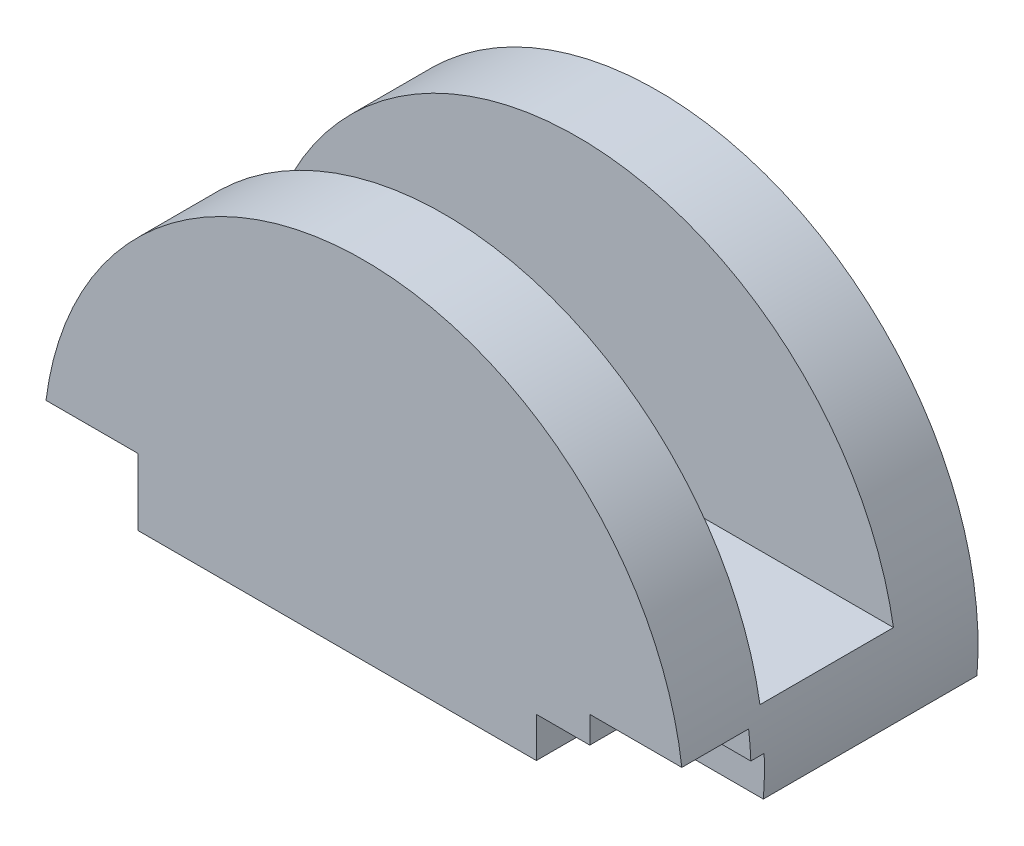
ISO-10303-21;
HEADER;
FILE_DESCRIPTION(('STEP AP214'),'2;1');
FILE_NAME('part.step','',(''),(''),'','','');
FILE_SCHEMA(('AUTOMOTIVE_DESIGN { 1 0 10303 214 1 1 1 1 }'));
ENDSEC;
DATA;
#1=APPLICATION_CONTEXT('core data for automotive mechanical design processes');
#2=APPLICATION_PROTOCOL_DEFINITION('international standard','automotive_design',2000,#1);
#3=PRODUCT_CONTEXT('',#1,'mechanical');
#4=PRODUCT('Part','Part','',(#3));
#5=PRODUCT_RELATED_PRODUCT_CATEGORY('part','',(#4));
#6=PRODUCT_DEFINITION_FORMATION('','',#4);
#7=PRODUCT_DEFINITION_CONTEXT('part definition',#1,'design');
#8=PRODUCT_DEFINITION('design','',#6,#7);
#9=PRODUCT_DEFINITION_SHAPE('','',#8);
#10=(LENGTH_UNIT() NAMED_UNIT(*) SI_UNIT(.MILLI.,.METRE.));
#11=(NAMED_UNIT(*) PLANE_ANGLE_UNIT() SI_UNIT($,.RADIAN.));
#12=(NAMED_UNIT(*) SI_UNIT($,.STERADIAN.) SOLID_ANGLE_UNIT());
#13=UNCERTAINTY_MEASURE_WITH_UNIT(LENGTH_MEASURE(1.E-05),#10,'distance_accuracy_value','');
#14=(GEOMETRIC_REPRESENTATION_CONTEXT(3) GLOBAL_UNCERTAINTY_ASSIGNED_CONTEXT((#13)) GLOBAL_UNIT_ASSIGNED_CONTEXT((#10,
#11,#12)) REPRESENTATION_CONTEXT('',''));
#15=CARTESIAN_POINT('',(0.,0.,0.));
#16=DIRECTION('',(0.,0.,1.));
#17=DIRECTION('',(1.,0.,0.));
#18=AXIS2_PLACEMENT_3D('',#15,#16,#17);
#19=CARTESIAN_POINT('',(0.,3.,5.5));
#20=DIRECTION('',(0.,1.,0.));
#21=DIRECTION('',(0.,0.,1.));
#22=AXIS2_PLACEMENT_3D('',#19,#20,#21);
#23=PLANE('',#22);
#24=CARTESIAN_POINT('',(0.,3.,5.5));
#25=DIRECTION('',(0.,1.,0.));
#26=DIRECTION('',(0.,0.,1.));
#27=AXIS2_PLACEMENT_3D('',#24,#25,#26);
#28=CIRCLE('',#27,4.25);
#29=CARTESIAN_POINT('',(-3.43693177121688,3.,8.));
#30=VERTEX_POINT('',#29);
#31=CARTESIAN_POINT('',(3.43693177121688,3.,8.));
#32=VERTEX_POINT('',#31);
#33=EDGE_CURVE('E246',#30,#32,#28,.T.);
#34=ORIENTED_EDGE('',*,*,#33,.F.);
#35=DIRECTION('',(1.,0.,0.));
#36=VECTOR('',#35,1.);
#37=CARTESIAN_POINT('',(0.,3.,8.));
#38=LINE('',#37,#36);
#39=EDGE_CURVE('E269',#30,#32,#38,.T.);
#40=ORIENTED_EDGE('',*,*,#39,.T.);
#41=EDGE_LOOP('',(#34,#40));
#42=FACE_BOUND('',#41,.T.);
#43=ADVANCED_FACE('F33',(#42),#23,.F.);
#44=CARTESIAN_POINT('',(0.,0.,11.));
#45=DIRECTION('',(0.,0.,-1.));
#46=DIRECTION('',(-1.,0.,0.));
#47=AXIS2_PLACEMENT_3D('',#44,#45,#46);
#48=CYLINDRICAL_SURFACE('',#47,12.);
#49=CARTESIAN_POINT('',(0.,0.,8.));
#50=DIRECTION('',(0.,0.,1.));
#51=DIRECTION('',(1.,0.,0.));
#52=AXIS2_PLACEMENT_3D('',#49,#50,#51);
#53=CIRCLE('',#52,12.);
#54=CARTESIAN_POINT('',(11.8321595661992,2.,8.));
#55=VERTEX_POINT('',#54);
#56=CARTESIAN_POINT('',(-11.8321595661992,2.,8.));
#57=VERTEX_POINT('',#56);
#58=EDGE_CURVE('E236',#55,#57,#53,.T.);
#59=ORIENTED_EDGE('',*,*,#58,.T.);
#60=DIRECTION('',(0.,0.,-1.));
#61=VECTOR('',#60,1.);
#62=CARTESIAN_POINT('',(-11.8321595661992,2.,11.));
#63=LINE('',#62,#61);
#64=CARTESIAN_POINT('',(-11.8321595661992,2.,3.));
#65=VERTEX_POINT('',#64);
#66=EDGE_CURVE('E242',#57,#65,#63,.T.);
#67=ORIENTED_EDGE('',*,*,#66,.T.);
#68=CARTESIAN_POINT('',(0.,0.,3.));
#69=DIRECTION('',(0.,0.,-1.));
#70=DIRECTION('',(-1.,0.,0.));
#71=AXIS2_PLACEMENT_3D('',#68,#69,#70);
#72=CIRCLE('',#71,12.);
#73=CARTESIAN_POINT('',(11.8321595661992,2.,3.));
#74=VERTEX_POINT('',#73);
#75=EDGE_CURVE('E229',#65,#74,#72,.T.);
#76=ORIENTED_EDGE('',*,*,#75,.T.);
#77=DIRECTION('',(0.,0.,-1.));
#78=VECTOR('',#77,1.);
#79=CARTESIAN_POINT('',(11.8321595661992,2.,11.));
#80=LINE('',#79,#78);
#81=EDGE_CURVE('E239',#74,#55,#80,.F.);
#82=ORIENTED_EDGE('',*,*,#81,.T.);
#83=EDGE_LOOP('',(#59,#67,#76,#82));
#84=FACE_BOUND('',#83,.T.);
#85=CARTESIAN_POINT('',(0.,0.,11.));
#86=DIRECTION('',(0.,0.,1.));
#87=DIRECTION('',(1.,0.,0.));
#88=AXIS2_PLACEMENT_3D('',#85,#86,#87);
#89=CIRCLE('',#88,12.);
#90=CARTESIAN_POINT('',(11.9058808997907,1.5,11.));
#91=VERTEX_POINT('',#90);
#92=CARTESIAN_POINT('',(-11.9058808997907,1.5,11.));
#93=VERTEX_POINT('',#92);
#94=EDGE_CURVE('E252',#91,#93,#89,.T.);
#95=ORIENTED_EDGE('',*,*,#94,.F.);
#96=DIRECTION('',(0.,0.,-1.));
#97=VECTOR('',#96,1.);
#98=CARTESIAN_POINT('',(11.9058808997907,1.5,11.));
#99=LINE('',#98,#97);
#100=CARTESIAN_POINT('',(11.9058808997907,1.5,8.5));
#101=VERTEX_POINT('',#100);
#102=EDGE_CURVE('E174',#91,#101,#99,.T.);
#103=ORIENTED_EDGE('',*,*,#102,.T.);
#104=CARTESIAN_POINT('',(0.,0.,8.5));
#105=DIRECTION('',(0.,0.,-1.));
#106=DIRECTION('',(-1.,0.,0.));
#107=AXIS2_PLACEMENT_3D('',#104,#105,#106);
#108=CIRCLE('',#107,12.);
#109=CARTESIAN_POINT('',(11.9895788082818,0.5,8.5));
#110=VERTEX_POINT('',#109);
#111=EDGE_CURVE('E154',#101,#110,#108,.T.);
#112=ORIENTED_EDGE('',*,*,#111,.T.);
#113=DIRECTION('',(0.,0.,-1.));
#114=VECTOR('',#113,1.);
#115=CARTESIAN_POINT('',(11.9895788082818,0.5,11.));
#116=LINE('',#115,#114);
#117=CARTESIAN_POINT('',(11.9895788082818,0.5,8.));
#118=VERTEX_POINT('',#117);
#119=EDGE_CURVE('E211',#110,#118,#116,.T.);
#120=ORIENTED_EDGE('',*,*,#119,.T.);
#121=CARTESIAN_POINT('',(0.,0.,8.));
#122=DIRECTION('',(0.,0.,-1.));
#123=DIRECTION('',(-1.,0.,0.));
#124=AXIS2_PLACEMENT_3D('',#121,#122,#123);
#125=CIRCLE('',#124,12.);
#126=CARTESIAN_POINT('',(11.9582607431014,-1.,8.));
#127=VERTEX_POINT('',#126);
#128=EDGE_CURVE('E215',#118,#127,#125,.T.);
#129=ORIENTED_EDGE('',*,*,#128,.T.);
#130=DIRECTION('',(0.,0.,-1.));
#131=VECTOR('',#130,1.);
#132=CARTESIAN_POINT('',(11.9582607431014,-1.,11.));
#133=LINE('',#132,#131);
#134=CARTESIAN_POINT('',(11.9582607431014,-1.,0.));
#135=VERTEX_POINT('',#134);
#136=EDGE_CURVE('E257',#127,#135,#133,.T.);
#137=ORIENTED_EDGE('',*,*,#136,.T.);
#138=CARTESIAN_POINT('',(0.,0.,0.));
#139=DIRECTION('',(0.,0.,1.));
#140=DIRECTION('',(1.,0.,0.));
#141=AXIS2_PLACEMENT_3D('',#138,#139,#140);
#142=CIRCLE('',#141,12.);
#143=CARTESIAN_POINT('',(-11.9582607431014,-1.,0.));
#144=VERTEX_POINT('',#143);
#145=EDGE_CURVE('E258',#135,#144,#142,.T.);
#146=ORIENTED_EDGE('',*,*,#145,.T.);
#147=DIRECTION('',(0.,0.,-1.));
#148=VECTOR('',#147,1.);
#149=CARTESIAN_POINT('',(-11.9582607431014,-1.,11.));
#150=LINE('',#149,#148);
#151=CARTESIAN_POINT('',(-11.9582607431014,-1.,8.5));
#152=VERTEX_POINT('',#151);
#153=EDGE_CURVE('E264',#152,#144,#150,.T.);
#154=ORIENTED_EDGE('',*,*,#153,.F.);
#155=CARTESIAN_POINT('',(0.,0.,8.5));
#156=DIRECTION('',(0.,0.,1.));
#157=DIRECTION('',(1.,0.,0.));
#158=AXIS2_PLACEMENT_3D('',#155,#156,#157);
#159=CIRCLE('',#158,12.);
#160=CARTESIAN_POINT('',(-11.9058808997907,1.5,8.5));
#161=VERTEX_POINT('',#160);
#162=EDGE_CURVE('E195',#161,#152,#159,.T.);
#163=ORIENTED_EDGE('',*,*,#162,.F.);
#164=DIRECTION('',(0.,0.,-1.));
#165=VECTOR('',#164,1.);
#166=CARTESIAN_POINT('',(-11.9058808997907,1.5,11.));
#167=LINE('',#166,#165);
#168=EDGE_CURVE('E191',#161,#93,#167,.F.);
#169=ORIENTED_EDGE('',*,*,#168,.T.);
#170=EDGE_LOOP('',(#95,#103,#112,#120,#129,#137,#146,#154,#163,#169));
#171=FACE_BOUND('',#170,.T.);
#172=ADVANCED_FACE('F35',(#84,#171),#48,.T.);
#173=CARTESIAN_POINT('',(-11.9582607431014,-1.,11.));
#174=DIRECTION('',(0.,1.,0.));
#175=DIRECTION('',(0.,0.,1.));
#176=AXIS2_PLACEMENT_3D('',#173,#174,#175);
#177=PLANE('',#176);
#178=CARTESIAN_POINT('',(0.,-1.,5.5));
#179=DIRECTION('',(0.,1.,0.));
#180=DIRECTION('',(0.,0.,1.));
#181=AXIS2_PLACEMENT_3D('',#178,#179,#180);
#182=CIRCLE('',#181,4.25);
#183=CARTESIAN_POINT('',(0.,-1.,9.75));
#184=VERTEX_POINT('',#183);
#185=EDGE_CURVE('E245',#184,#184,#182,.T.);
#186=ORIENTED_EDGE('',*,*,#185,.T.);
#187=EDGE_LOOP('',(#186));
#188=FACE_BOUND('',#187,.T.);
#189=DIRECTION('',(1.,0.,0.));
#190=VECTOR('',#189,1.);
#191=CARTESIAN_POINT('',(-11.9582607431014,-1.,11.));
#192=LINE('',#191,#190);
#193=CARTESIAN_POINT('',(-8.4582607431014,-1.,11.));
#194=VERTEX_POINT('',#193);
#195=CARTESIAN_POINT('',(6.4582607431014,-1.,11.));
#196=VERTEX_POINT('',#195);
#197=EDGE_CURVE('E254',#194,#196,#192,.T.);
#198=ORIENTED_EDGE('',*,*,#197,.F.);
#199=DIRECTION('',(0.,0.,1.));
#200=VECTOR('',#199,1.);
#201=CARTESIAN_POINT('',(-8.4582607431014,-1.,8.5));
#202=LINE('',#201,#200);
#203=CARTESIAN_POINT('',(-8.4582607431014,-1.,8.5));
#204=VERTEX_POINT('',#203);
#205=EDGE_CURVE('E189',#204,#194,#202,.T.);
#206=ORIENTED_EDGE('',*,*,#205,.F.);
#207=DIRECTION('',(1.,0.,0.));
#208=VECTOR('',#207,1.);
#209=CARTESIAN_POINT('',(-8.4582607431014,-1.,8.5));
#210=LINE('',#209,#208);
#211=EDGE_CURVE('E183',#152,#204,#210,.T.);
#212=ORIENTED_EDGE('',*,*,#211,.F.);
#213=ORIENTED_EDGE('',*,*,#153,.T.);
#214=DIRECTION('',(1.,0.,0.));
#215=VECTOR('',#214,1.);
#216=CARTESIAN_POINT('',(-11.9582607431014,-1.,0.));
#217=LINE('',#216,#215);
#218=EDGE_CURVE('E255',#144,#135,#217,.T.);
#219=ORIENTED_EDGE('',*,*,#218,.T.);
#220=ORIENTED_EDGE('',*,*,#136,.F.);
#221=DIRECTION('',(1.,0.,0.));
#222=VECTOR('',#221,1.);
#223=CARTESIAN_POINT('',(6.4582607431014,-1.,8.));
#224=LINE('',#223,#222);
#225=CARTESIAN_POINT('',(6.4582607431014,-1.,8.));
#226=VERTEX_POINT('',#225);
#227=EDGE_CURVE('E201',#226,#127,#224,.T.);
#228=ORIENTED_EDGE('',*,*,#227,.F.);
#229=DIRECTION('',(0.,0.,1.));
#230=VECTOR('',#229,1.);
#231=CARTESIAN_POINT('',(6.4582607431014,-1.,8.));
#232=LINE('',#231,#230);
#233=EDGE_CURVE('E205',#226,#196,#232,.T.);
#234=ORIENTED_EDGE('',*,*,#233,.T.);
#235=EDGE_LOOP('',(#198,#206,#212,#213,#219,#220,#228,#234));
#236=FACE_BOUND('',#235,.T.);
#237=ADVANCED_FACE('F298',(#188,#236),#177,.F.);
#238=CARTESIAN_POINT('',(0.,0.,11.));
#239=DIRECTION('',(0.,0.,1.));
#240=DIRECTION('',(1.,0.,0.));
#241=AXIS2_PLACEMENT_3D('',#238,#239,#240);
#242=PLANE('',#241);
#243=DIRECTION('',(0.,-1.,0.));
#244=VECTOR('',#243,1.);
#245=CARTESIAN_POINT('',(8.4582607431014,-1.,11.));
#246=LINE('',#245,#244);
#247=CARTESIAN_POINT('',(8.4582607431014,1.5,11.));
#248=VERTEX_POINT('',#247);
#249=CARTESIAN_POINT('',(8.4582607431014,0.5,11.));
#250=VERTEX_POINT('',#249);
#251=EDGE_CURVE('E169',#248,#250,#246,.T.);
#252=ORIENTED_EDGE('',*,*,#251,.F.);
#253=DIRECTION('',(-1.,0.,0.));
#254=VECTOR('',#253,1.);
#255=CARTESIAN_POINT('',(8.4582607431014,1.5,11.));
#256=LINE('',#255,#254);
#257=EDGE_CURVE('E162',#91,#248,#256,.T.);
#258=ORIENTED_EDGE('',*,*,#257,.F.);
#259=ORIENTED_EDGE('',*,*,#94,.T.);
#260=DIRECTION('',(-1.,0.,0.));
#261=VECTOR('',#260,1.);
#262=CARTESIAN_POINT('',(-8.4582607431014,1.5,11.));
#263=LINE('',#262,#261);
#264=CARTESIAN_POINT('',(-8.4582607431014,1.5,11.));
#265=VERTEX_POINT('',#264);
#266=EDGE_CURVE('E180',#265,#93,#263,.T.);
#267=ORIENTED_EDGE('',*,*,#266,.F.);
#268=DIRECTION('',(0.,1.,0.));
#269=VECTOR('',#268,1.);
#270=CARTESIAN_POINT('',(-8.4582607431014,-1.,11.));
#271=LINE('',#270,#269);
#272=EDGE_CURVE('E56',#194,#265,#271,.T.);
#273=ORIENTED_EDGE('',*,*,#272,.F.);
#274=ORIENTED_EDGE('',*,*,#197,.T.);
#275=DIRECTION('',(0.,-1.,0.));
#276=VECTOR('',#275,1.);
#277=CARTESIAN_POINT('',(6.4582607431014,-1.,11.));
#278=LINE('',#277,#276);
#279=CARTESIAN_POINT('',(6.4582607431014,0.5,11.));
#280=VERTEX_POINT('',#279);
#281=EDGE_CURVE('E197',#280,#196,#278,.T.);
#282=ORIENTED_EDGE('',*,*,#281,.F.);
#283=DIRECTION('',(-1.,0.,0.));
#284=VECTOR('',#283,1.);
#285=CARTESIAN_POINT('',(0.,0.5,11.));
#286=LINE('',#285,#284);
#287=EDGE_CURVE('E275',#250,#280,#286,.T.);
#288=ORIENTED_EDGE('',*,*,#287,.F.);
#289=EDGE_LOOP('',(#252,#258,#259,#267,#273,#274,#282,#288));
#290=FACE_BOUND('',#289,.T.);
#291=ADVANCED_FACE('F285',(#290),#242,.T.);
#292=CARTESIAN_POINT('',(0.,0.,0.));
#293=DIRECTION('',(0.,0.,1.));
#294=DIRECTION('',(1.,0.,0.));
#295=AXIS2_PLACEMENT_3D('',#292,#293,#294);
#296=PLANE('',#295);
#297=ORIENTED_EDGE('',*,*,#145,.F.);
#298=ORIENTED_EDGE('',*,*,#218,.F.);
#299=EDGE_LOOP('',(#297,#298));
#300=FACE_BOUND('',#299,.T.);
#301=ADVANCED_FACE('F304',(#300),#296,.F.);
#302=CARTESIAN_POINT('',(0.,3.,5.5));
#303=DIRECTION('',(0.,-1.,0.));
#304=DIRECTION('',(0.,0.,-1.));
#305=AXIS2_PLACEMENT_3D('',#302,#303,#304);
#306=CYLINDRICAL_SURFACE('',#305,4.25);
#307=DIRECTION('',(0.,-1.,0.));
#308=VECTOR('',#307,1.);
#309=CARTESIAN_POINT('',(3.43693177121688,3.,8.));
#310=LINE('',#309,#308);
#311=CARTESIAN_POINT('',(3.43693177121688,2.,8.));
#312=VERTEX_POINT('',#311);
#313=EDGE_CURVE('E232',#312,#32,#310,.F.);
#314=ORIENTED_EDGE('',*,*,#313,.F.);
#315=CARTESIAN_POINT('',(0.,2.,5.5));
#316=DIRECTION('',(0.,-1.,0.));
#317=DIRECTION('',(0.,0.,-1.));
#318=AXIS2_PLACEMENT_3D('',#315,#316,#317);
#319=CIRCLE('',#318,4.25);
#320=CARTESIAN_POINT('',(3.43693177121688,2.,3.));
#321=VERTEX_POINT('',#320);
#322=EDGE_CURVE('E274',#321,#312,#319,.T.);
#323=ORIENTED_EDGE('',*,*,#322,.F.);
#324=DIRECTION('',(0.,-1.,0.));
#325=VECTOR('',#324,1.);
#326=CARTESIAN_POINT('',(3.43693177121688,3.,3.));
#327=LINE('',#326,#325);
#328=CARTESIAN_POINT('',(3.43693177121688,3.,3.));
#329=VERTEX_POINT('',#328);
#330=EDGE_CURVE('E227',#329,#321,#327,.T.);
#331=ORIENTED_EDGE('',*,*,#330,.F.);
#332=CARTESIAN_POINT('',(-3.43693177121688,3.,3.));
#333=VERTEX_POINT('',#332);
#334=EDGE_CURVE('E249',#329,#333,#28,.T.);
#335=ORIENTED_EDGE('',*,*,#334,.T.);
#336=DIRECTION('',(0.,-1.,0.));
#337=VECTOR('',#336,1.);
#338=CARTESIAN_POINT('',(-3.43693177121688,3.,3.));
#339=LINE('',#338,#337);
#340=CARTESIAN_POINT('',(-3.43693177121688,2.,3.));
#341=VERTEX_POINT('',#340);
#342=EDGE_CURVE('E225',#341,#333,#339,.F.);
#343=ORIENTED_EDGE('',*,*,#342,.F.);
#344=CARTESIAN_POINT('',(-3.43693177121688,2.,8.));
#345=VERTEX_POINT('',#344);
#346=EDGE_CURVE('E272',#345,#341,#319,.T.);
#347=ORIENTED_EDGE('',*,*,#346,.F.);
#348=DIRECTION('',(0.,-1.,0.));
#349=VECTOR('',#348,1.);
#350=CARTESIAN_POINT('',(-3.43693177121688,3.,8.));
#351=LINE('',#350,#349);
#352=EDGE_CURVE('E234',#30,#345,#351,.T.);
#353=ORIENTED_EDGE('',*,*,#352,.F.);
#354=ORIENTED_EDGE('',*,*,#33,.T.);
#355=EDGE_LOOP('',(#314,#323,#331,#335,#343,#347,#353,#354));
#356=FACE_BOUND('',#355,.T.);
#357=ORIENTED_EDGE('',*,*,#185,.F.);
#358=EDGE_LOOP('',(#357));
#359=FACE_BOUND('',#358,.T.);
#360=ADVANCED_FACE('F306',(#356,#359),#306,.F.);
#361=ORIENTED_EDGE('',*,*,#334,.F.);
#362=DIRECTION('',(-1.,0.,0.));
#363=VECTOR('',#362,1.);
#364=CARTESIAN_POINT('',(0.,3.,3.));
#365=LINE('',#364,#363);
#366=EDGE_CURVE('E266',#329,#333,#365,.T.);
#367=ORIENTED_EDGE('',*,*,#366,.T.);
#368=EDGE_LOOP('',(#361,#367));
#369=FACE_BOUND('',#368,.T.);
#370=ADVANCED_FACE('F312',(#369),#23,.F.);
#371=CARTESIAN_POINT('',(-12.,2.,8.));
#372=DIRECTION('',(0.,-1.,0.));
#373=DIRECTION('',(0.,0.,-1.));
#374=AXIS2_PLACEMENT_3D('',#371,#372,#373);
#375=PLANE('',#374);
#376=DIRECTION('',(1.,0.,0.));
#377=VECTOR('',#376,1.);
#378=CARTESIAN_POINT('',(-12.,2.,8.));
#379=LINE('',#378,#377);
#380=EDGE_CURVE('E223',#57,#345,#379,.T.);
#381=ORIENTED_EDGE('',*,*,#380,.T.);
#382=ORIENTED_EDGE('',*,*,#346,.T.);
#383=DIRECTION('',(1.,0.,0.));
#384=VECTOR('',#383,1.);
#385=CARTESIAN_POINT('',(-12.,2.,3.));
#386=LINE('',#385,#384);
#387=EDGE_CURVE('E222',#65,#341,#386,.T.);
#388=ORIENTED_EDGE('',*,*,#387,.F.);
#389=ORIENTED_EDGE('',*,*,#66,.F.);
#390=EDGE_LOOP('',(#381,#382,#388,#389));
#391=FACE_BOUND('',#390,.T.);
#392=ADVANCED_FACE('F326',(#391),#375,.F.);
#393=EDGE_CURVE('E219',#321,#74,#386,.T.);
#394=ORIENTED_EDGE('',*,*,#393,.F.);
#395=ORIENTED_EDGE('',*,*,#322,.T.);
#396=EDGE_CURVE('E218',#312,#55,#379,.T.);
#397=ORIENTED_EDGE('',*,*,#396,.T.);
#398=ORIENTED_EDGE('',*,*,#81,.F.);
#399=EDGE_LOOP('',(#394,#395,#397,#398));
#400=FACE_BOUND('',#399,.T.);
#401=ADVANCED_FACE('F331',(#400),#375,.F.);
#402=CARTESIAN_POINT('',(-12.,2.,8.));
#403=DIRECTION('',(0.,0.,1.));
#404=DIRECTION('',(1.,0.,0.));
#405=AXIS2_PLACEMENT_3D('',#402,#403,#404);
#406=PLANE('',#405);
#407=ORIENTED_EDGE('',*,*,#396,.F.);
#408=ORIENTED_EDGE('',*,*,#313,.T.);
#409=ORIENTED_EDGE('',*,*,#39,.F.);
#410=ORIENTED_EDGE('',*,*,#352,.T.);
#411=ORIENTED_EDGE('',*,*,#380,.F.);
#412=ORIENTED_EDGE('',*,*,#58,.F.);
#413=EDGE_LOOP('',(#407,#408,#409,#410,#411,#412));
#414=FACE_BOUND('',#413,.T.);
#415=ADVANCED_FACE('F354',(#414),#406,.F.);
#416=CARTESIAN_POINT('',(-12.,2.,3.));
#417=DIRECTION('',(0.,0.,-1.));
#418=DIRECTION('',(-1.,0.,0.));
#419=AXIS2_PLACEMENT_3D('',#416,#417,#418);
#420=PLANE('',#419);
#421=ORIENTED_EDGE('',*,*,#387,.T.);
#422=ORIENTED_EDGE('',*,*,#342,.T.);
#423=ORIENTED_EDGE('',*,*,#366,.F.);
#424=ORIENTED_EDGE('',*,*,#330,.T.);
#425=ORIENTED_EDGE('',*,*,#393,.T.);
#426=ORIENTED_EDGE('',*,*,#75,.F.);
#427=EDGE_LOOP('',(#421,#422,#423,#424,#425,#426));
#428=FACE_BOUND('',#427,.T.);
#429=ADVANCED_FACE('F345',(#428),#420,.F.);
#430=CARTESIAN_POINT('',(0.,0.,8.));
#431=DIRECTION('',(0.,0.,-1.));
#432=DIRECTION('',(-1.,0.,0.));
#433=AXIS2_PLACEMENT_3D('',#430,#431,#432);
#434=PLANE('',#433);
#435=DIRECTION('',(-1.,0.,0.));
#436=VECTOR('',#435,1.);
#437=CARTESIAN_POINT('',(6.4582607431014,0.5,8.));
#438=LINE('',#437,#436);
#439=CARTESIAN_POINT('',(6.4582607431014,0.5,8.));
#440=VERTEX_POINT('',#439);
#441=EDGE_CURVE('E203',#118,#440,#438,.T.);
#442=ORIENTED_EDGE('',*,*,#441,.T.);
#443=DIRECTION('',(0.,-1.,0.));
#444=VECTOR('',#443,1.);
#445=CARTESIAN_POINT('',(6.4582607431014,-1.,8.));
#446=LINE('',#445,#444);
#447=EDGE_CURVE('E198',#440,#226,#446,.T.);
#448=ORIENTED_EDGE('',*,*,#447,.T.);
#449=ORIENTED_EDGE('',*,*,#227,.T.);
#450=ORIENTED_EDGE('',*,*,#128,.F.);
#451=EDGE_LOOP('',(#442,#448,#449,#450));
#452=FACE_BOUND('',#451,.T.);
#453=ADVANCED_FACE('F294',(#452),#434,.F.);
#454=CARTESIAN_POINT('',(6.4582607431014,0.5,8.));
#455=DIRECTION('',(0.,1.,0.));
#456=DIRECTION('',(0.,0.,1.));
#457=AXIS2_PLACEMENT_3D('',#454,#455,#456);
#458=PLANE('',#457);
#459=DIRECTION('',(-1.,0.,0.));
#460=VECTOR('',#459,1.);
#461=CARTESIAN_POINT('',(6.4582607431014,0.5,8.5));
#462=LINE('',#461,#460);
#463=CARTESIAN_POINT('',(8.4582607431014,0.5,8.5));
#464=VERTEX_POINT('',#463);
#465=EDGE_CURVE('E41',#110,#464,#462,.T.);
#466=ORIENTED_EDGE('',*,*,#465,.T.);
#467=DIRECTION('',(0.,0.,1.));
#468=VECTOR('',#467,1.);
#469=CARTESIAN_POINT('',(8.4582607431014,0.5,8.));
#470=LINE('',#469,#468);
#471=EDGE_CURVE('E11',#464,#250,#470,.T.);
#472=ORIENTED_EDGE('',*,*,#471,.T.);
#473=ORIENTED_EDGE('',*,*,#287,.T.);
#474=DIRECTION('',(0.,0.,1.));
#475=VECTOR('',#474,1.);
#476=CARTESIAN_POINT('',(6.4582607431014,0.5,8.));
#477=LINE('',#476,#475);
#478=EDGE_CURVE('E208',#440,#280,#477,.T.);
#479=ORIENTED_EDGE('',*,*,#478,.F.);
#480=ORIENTED_EDGE('',*,*,#441,.F.);
#481=ORIENTED_EDGE('',*,*,#119,.F.);
#482=EDGE_LOOP('',(#466,#472,#473,#479,#480,#481));
#483=FACE_BOUND('',#482,.T.);
#484=ADVANCED_FACE('F278',(#483),#458,.F.);
#485=CARTESIAN_POINT('',(6.4582607431014,-1.,8.));
#486=DIRECTION('',(-1.,0.,0.));
#487=DIRECTION('',(0.,-1.,0.));
#488=AXIS2_PLACEMENT_3D('',#485,#486,#487);
#489=PLANE('',#488);
#490=ORIENTED_EDGE('',*,*,#281,.T.);
#491=ORIENTED_EDGE('',*,*,#233,.F.);
#492=ORIENTED_EDGE('',*,*,#447,.F.);
#493=ORIENTED_EDGE('',*,*,#478,.T.);
#494=EDGE_LOOP('',(#490,#491,#492,#493));
#495=FACE_BOUND('',#494,.T.);
#496=ADVANCED_FACE('F291',(#495),#489,.F.);
#497=CARTESIAN_POINT('',(0.,0.,8.5));
#498=DIRECTION('',(0.,0.,1.));
#499=DIRECTION('',(1.,0.,0.));
#500=AXIS2_PLACEMENT_3D('',#497,#498,#499);
#501=PLANE('',#500);
#502=ORIENTED_EDGE('',*,*,#162,.T.);
#503=ORIENTED_EDGE('',*,*,#211,.T.);
#504=DIRECTION('',(0.,1.,0.));
#505=VECTOR('',#504,1.);
#506=CARTESIAN_POINT('',(-8.4582607431014,-1.,8.5));
#507=LINE('',#506,#505);
#508=CARTESIAN_POINT('',(-8.4582607431014,1.5,8.5));
#509=VERTEX_POINT('',#508);
#510=EDGE_CURVE('E176',#204,#509,#507,.T.);
#511=ORIENTED_EDGE('',*,*,#510,.T.);
#512=DIRECTION('',(-1.,0.,0.));
#513=VECTOR('',#512,1.);
#514=CARTESIAN_POINT('',(-8.4582607431014,1.5,8.5));
#515=LINE('',#514,#513);
#516=EDGE_CURVE('E179',#509,#161,#515,.T.);
#517=ORIENTED_EDGE('',*,*,#516,.T.);
#518=EDGE_LOOP('',(#502,#503,#511,#517));
#519=FACE_BOUND('',#518,.T.);
#520=ADVANCED_FACE('F364',(#519),#501,.T.);
#521=CARTESIAN_POINT('',(-8.4582607431014,1.5,8.5));
#522=DIRECTION('',(0.,1.,0.));
#523=DIRECTION('',(-1.,0.,0.));
#524=AXIS2_PLACEMENT_3D('',#521,#522,#523);
#525=PLANE('',#524);
#526=ORIENTED_EDGE('',*,*,#516,.F.);
#527=DIRECTION('',(0.,0.,1.));
#528=VECTOR('',#527,1.);
#529=CARTESIAN_POINT('',(-8.4582607431014,1.5,8.5));
#530=LINE('',#529,#528);
#531=EDGE_CURVE('E185',#509,#265,#530,.T.);
#532=ORIENTED_EDGE('',*,*,#531,.T.);
#533=ORIENTED_EDGE('',*,*,#266,.T.);
#534=ORIENTED_EDGE('',*,*,#168,.F.);
#535=EDGE_LOOP('',(#526,#532,#533,#534));
#536=FACE_BOUND('',#535,.T.);
#537=ADVANCED_FACE('F372',(#536),#525,.F.);
#538=CARTESIAN_POINT('',(-8.4582607431014,-1.,8.5));
#539=DIRECTION('',(1.,0.,0.));
#540=DIRECTION('',(0.,0.,-1.));
#541=AXIS2_PLACEMENT_3D('',#538,#539,#540);
#542=PLANE('',#541);
#543=ORIENTED_EDGE('',*,*,#272,.T.);
#544=ORIENTED_EDGE('',*,*,#531,.F.);
#545=ORIENTED_EDGE('',*,*,#510,.F.);
#546=ORIENTED_EDGE('',*,*,#205,.T.);
#547=EDGE_LOOP('',(#543,#544,#545,#546));
#548=FACE_BOUND('',#547,.T.);
#549=ADVANCED_FACE('F369',(#548),#542,.F.);
#550=CARTESIAN_POINT('',(8.4582607431014,1.5,8.5));
#551=DIRECTION('',(0.,1.,0.));
#552=DIRECTION('',(0.,0.,1.));
#553=AXIS2_PLACEMENT_3D('',#550,#551,#552);
#554=PLANE('',#553);
#555=ORIENTED_EDGE('',*,*,#257,.T.);
#556=DIRECTION('',(0.,0.,1.));
#557=VECTOR('',#556,1.);
#558=CARTESIAN_POINT('',(8.4582607431014,1.5,8.5));
#559=LINE('',#558,#557);
#560=CARTESIAN_POINT('',(8.4582607431014,1.5,8.5));
#561=VERTEX_POINT('',#560);
#562=EDGE_CURVE('E157',#561,#248,#559,.T.);
#563=ORIENTED_EDGE('',*,*,#562,.F.);
#564=DIRECTION('',(-1.,0.,0.));
#565=VECTOR('',#564,1.);
#566=CARTESIAN_POINT('',(8.4582607431014,1.5,8.5));
#567=LINE('',#566,#565);
#568=EDGE_CURVE('E150',#101,#561,#567,.T.);
#569=ORIENTED_EDGE('',*,*,#568,.F.);
#570=ORIENTED_EDGE('',*,*,#102,.F.);
#571=EDGE_LOOP('',(#555,#563,#569,#570));
#572=FACE_BOUND('',#571,.T.);
#573=ADVANCED_FACE('F160',(#572),#554,.F.);
#574=CARTESIAN_POINT('',(8.4582607431014,-1.,8.5));
#575=DIRECTION('',(-1.,0.,0.));
#576=DIRECTION('',(0.,0.,1.));
#577=AXIS2_PLACEMENT_3D('',#574,#575,#576);
#578=PLANE('',#577);
#579=DIRECTION('',(0.,-1.,0.));
#580=VECTOR('',#579,1.);
#581=CARTESIAN_POINT('',(8.4582607431014,-1.,8.5));
#582=LINE('',#581,#580);
#583=EDGE_CURVE('E48',#561,#464,#582,.T.);
#584=ORIENTED_EDGE('',*,*,#583,.F.);
#585=ORIENTED_EDGE('',*,*,#562,.T.);
#586=ORIENTED_EDGE('',*,*,#251,.T.);
#587=ORIENTED_EDGE('',*,*,#471,.F.);
#588=EDGE_LOOP('',(#584,#585,#586,#587));
#589=FACE_BOUND('',#588,.T.);
#590=ADVANCED_FACE('F166',(#589),#578,.F.);
#591=CARTESIAN_POINT('',(0.,0.,8.5));
#592=DIRECTION('',(0.,0.,-1.));
#593=DIRECTION('',(-1.,0.,0.));
#594=AXIS2_PLACEMENT_3D('',#591,#592,#593);
#595=PLANE('',#594);
#596=ORIENTED_EDGE('',*,*,#568,.T.);
#597=ORIENTED_EDGE('',*,*,#583,.T.);
#598=ORIENTED_EDGE('',*,*,#465,.F.);
#599=ORIENTED_EDGE('',*,*,#111,.F.);
#600=EDGE_LOOP('',(#596,#597,#598,#599));
#601=FACE_BOUND('',#600,.T.);
#602=ADVANCED_FACE('F152',(#601),#595,.F.);
#603=CLOSED_SHELL('',(#43,#172,#237,#291,#301,#360,#370,#392,#401,#415,#429,#453,#484,#496,#520,
#537,#549,#573,#590,#602));
#604=MANIFOLD_SOLID_BREP('B2',#603);
#605=ADVANCED_BREP_SHAPE_REPRESENTATION('',(#18,#604),#14);
#606=SHAPE_DEFINITION_REPRESENTATION(#9,#605);
ENDSEC;
END-ISO-10303-21;
